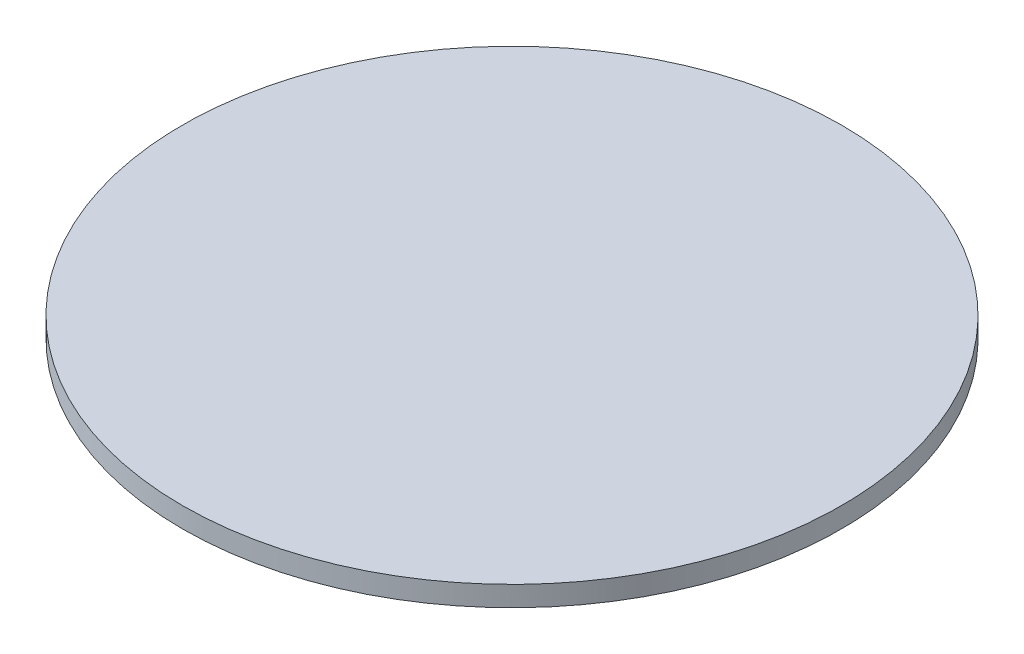
ISO-10303-21;
HEADER;
FILE_DESCRIPTION(('STEP AP214'),'2;1');
FILE_NAME('part.step','',(''),(''),'','','');
FILE_SCHEMA(('AUTOMOTIVE_DESIGN { 1 0 10303 214 1 1 1 1 }'));
ENDSEC;
DATA;
#1=APPLICATION_CONTEXT('core data for automotive mechanical design processes');
#2=APPLICATION_PROTOCOL_DEFINITION('international standard','automotive_design',2000,#1);
#3=PRODUCT_CONTEXT('',#1,'mechanical');
#4=PRODUCT('Part','Part','',(#3));
#5=PRODUCT_RELATED_PRODUCT_CATEGORY('part','',(#4));
#6=PRODUCT_DEFINITION_FORMATION('','',#4);
#7=PRODUCT_DEFINITION_CONTEXT('part definition',#1,'design');
#8=PRODUCT_DEFINITION('design','',#6,#7);
#9=PRODUCT_DEFINITION_SHAPE('','',#8);
#10=(LENGTH_UNIT() NAMED_UNIT(*) SI_UNIT(.MILLI.,.METRE.));
#11=(NAMED_UNIT(*) PLANE_ANGLE_UNIT() SI_UNIT($,.RADIAN.));
#12=(NAMED_UNIT(*) SI_UNIT($,.STERADIAN.) SOLID_ANGLE_UNIT());
#13=UNCERTAINTY_MEASURE_WITH_UNIT(LENGTH_MEASURE(1.E-05),#10,'distance_accuracy_value','');
#14=(GEOMETRIC_REPRESENTATION_CONTEXT(3) GLOBAL_UNCERTAINTY_ASSIGNED_CONTEXT((#13)) GLOBAL_UNIT_ASSIGNED_CONTEXT((#10,
#11,#12)) REPRESENTATION_CONTEXT('',''));
#15=CARTESIAN_POINT('',(0.,0.,0.));
#16=DIRECTION('',(0.,0.,1.));
#17=DIRECTION('',(1.,0.,0.));
#18=AXIS2_PLACEMENT_3D('',#15,#16,#17);
#19=CARTESIAN_POINT('',(0.,1.,0.));
#20=DIRECTION('',(0.,-1.,0.));
#21=DIRECTION('',(0.,0.,-1.));
#22=AXIS2_PLACEMENT_3D('',#19,#20,#21);
#23=CYLINDRICAL_SURFACE('',#22,16.3);
#24=CARTESIAN_POINT('',(0.,1.,0.));
#25=DIRECTION('',(0.,1.,0.));
#26=DIRECTION('',(0.,0.,1.));
#27=AXIS2_PLACEMENT_3D('',#24,#25,#26);
#28=CIRCLE('',#27,16.3);
#29=CARTESIAN_POINT('',(0.,1.,16.3));
#30=VERTEX_POINT('',#29);
#31=EDGE_CURVE('E10',#30,#30,#28,.T.);
#32=ORIENTED_EDGE('',*,*,#31,.F.);
#33=EDGE_LOOP('',(#32));
#34=FACE_BOUND('',#33,.T.);
#35=CARTESIAN_POINT('',(0.,0.,0.));
#36=DIRECTION('',(0.,1.,0.));
#37=DIRECTION('',(0.,0.,1.));
#38=AXIS2_PLACEMENT_3D('',#35,#36,#37);
#39=CIRCLE('',#38,16.3);
#40=CARTESIAN_POINT('',(0.,0.,16.3));
#41=VERTEX_POINT('',#40);
#42=EDGE_CURVE('E34',#41,#41,#39,.T.);
#43=ORIENTED_EDGE('',*,*,#42,.T.);
#44=EDGE_LOOP('',(#43));
#45=FACE_BOUND('',#44,.T.);
#46=ADVANCED_FACE('F31',(#34,#45),#23,.T.);
#47=CARTESIAN_POINT('',(0.,1.,0.));
#48=DIRECTION('',(0.,1.,0.));
#49=DIRECTION('',(0.,0.,1.));
#50=AXIS2_PLACEMENT_3D('',#47,#48,#49);
#51=PLANE('',#50);
#52=ORIENTED_EDGE('',*,*,#31,.T.);
#53=EDGE_LOOP('',(#52));
#54=FACE_BOUND('',#53,.T.);
#55=ADVANCED_FACE('F46',(#54),#51,.T.);
#56=CARTESIAN_POINT('',(0.,0.,0.));
#57=DIRECTION('',(0.,1.,0.));
#58=DIRECTION('',(0.,0.,1.));
#59=AXIS2_PLACEMENT_3D('',#56,#57,#58);
#60=PLANE('',#59);
#61=ORIENTED_EDGE('',*,*,#42,.F.);
#62=EDGE_LOOP('',(#61));
#63=FACE_BOUND('',#62,.T.);
#64=ADVANCED_FACE('F44',(#63),#60,.F.);
#65=CLOSED_SHELL('',(#46,#55,#64));
#66=MANIFOLD_SOLID_BREP('B2',#65);
#67=ADVANCED_BREP_SHAPE_REPRESENTATION('',(#18,#66),#14);
#68=SHAPE_DEFINITION_REPRESENTATION(#9,#67);
ENDSEC;
END-ISO-10303-21;
